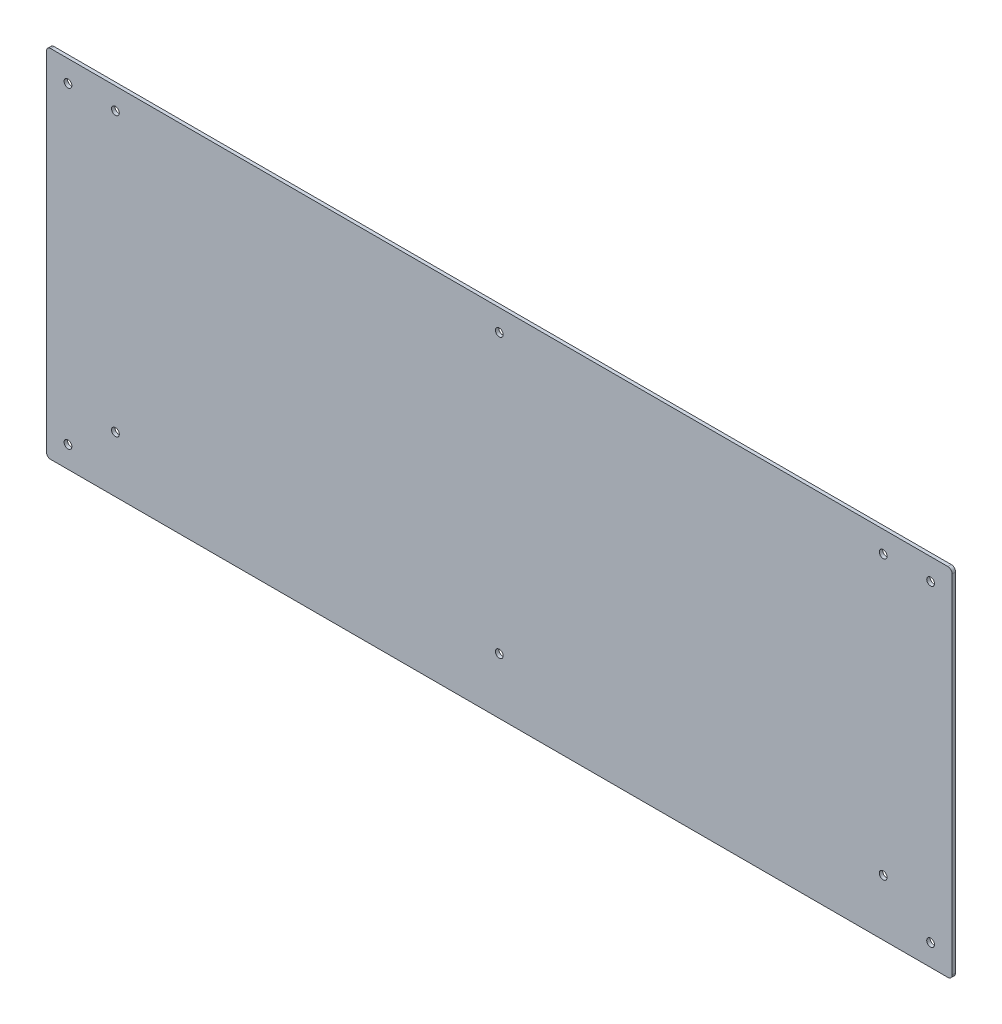
ISO-10303-21;
HEADER;
FILE_DESCRIPTION(('STEP AP214'),'2;1');
FILE_NAME('part.step','',(''),(''),'','','');
FILE_SCHEMA(('AUTOMOTIVE_DESIGN { 1 0 10303 214 1 1 1 1 }'));
ENDSEC;
DATA;
#1=APPLICATION_CONTEXT('core data for automotive mechanical design processes');
#2=APPLICATION_PROTOCOL_DEFINITION('international standard','automotive_design',2000,#1);
#3=PRODUCT_CONTEXT('',#1,'mechanical');
#4=PRODUCT('Part','Part','',(#3));
#5=PRODUCT_RELATED_PRODUCT_CATEGORY('part','',(#4));
#6=PRODUCT_DEFINITION_FORMATION('','',#4);
#7=PRODUCT_DEFINITION_CONTEXT('part definition',#1,'design');
#8=PRODUCT_DEFINITION('design','',#6,#7);
#9=PRODUCT_DEFINITION_SHAPE('','',#8);
#10=(LENGTH_UNIT() NAMED_UNIT(*) SI_UNIT(.MILLI.,.METRE.));
#11=(NAMED_UNIT(*) PLANE_ANGLE_UNIT() SI_UNIT($,.RADIAN.));
#12=(NAMED_UNIT(*) SI_UNIT($,.STERADIAN.) SOLID_ANGLE_UNIT());
#13=UNCERTAINTY_MEASURE_WITH_UNIT(LENGTH_MEASURE(1.E-05),#10,'distance_accuracy_value','');
#14=(GEOMETRIC_REPRESENTATION_CONTEXT(3) GLOBAL_UNCERTAINTY_ASSIGNED_CONTEXT((#13)) GLOBAL_UNIT_ASSIGNED_CONTEXT((#10,
#11,#12)) REPRESENTATION_CONTEXT('',''));
#15=CARTESIAN_POINT('',(0.,0.,0.));
#16=DIRECTION('',(0.,0.,1.));
#17=DIRECTION('',(1.,0.,0.));
#18=AXIS2_PLACEMENT_3D('',#15,#16,#17);
#19=CARTESIAN_POINT('',(-210.,-82.5,-1.588));
#20=DIRECTION('',(-1.,0.,0.));
#21=DIRECTION('',(0.,0.,1.));
#22=AXIS2_PLACEMENT_3D('',#19,#20,#21);
#23=PLANE('',#22);
#24=DIRECTION('',(0.,-1.,0.));
#25=VECTOR('',#24,1.);
#26=CARTESIAN_POINT('',(-210.,-82.5,-1.588));
#27=LINE('',#26,#25);
#28=CARTESIAN_POINT('',(-210.,80.5,-1.588));
#29=VERTEX_POINT('',#28);
#30=CARTESIAN_POINT('',(-210.,-80.5,-1.588));
#31=VERTEX_POINT('',#30);
#32=EDGE_CURVE('E158',#29,#31,#27,.T.);
#33=ORIENTED_EDGE('',*,*,#32,.T.);
#34=DIRECTION('',(0.,0.,1.));
#35=VECTOR('',#34,1.);
#36=CARTESIAN_POINT('',(-210.,-80.5,-1.588));
#37=LINE('',#36,#35);
#38=CARTESIAN_POINT('',(-210.,-80.5,0.));
#39=VERTEX_POINT('',#38);
#40=EDGE_CURVE('E11',#31,#39,#37,.T.);
#41=ORIENTED_EDGE('',*,*,#40,.T.);
#42=DIRECTION('',(0.,-1.,0.));
#43=VECTOR('',#42,1.);
#44=CARTESIAN_POINT('',(-210.,-82.5,0.));
#45=LINE('',#44,#43);
#46=CARTESIAN_POINT('',(-210.,80.5,0.));
#47=VERTEX_POINT('',#46);
#48=EDGE_CURVE('E161',#47,#39,#45,.T.);
#49=ORIENTED_EDGE('',*,*,#48,.F.);
#50=DIRECTION('',(0.,0.,1.));
#51=VECTOR('',#50,1.);
#52=CARTESIAN_POINT('',(-210.,80.5,-1.588));
#53=LINE('',#52,#51);
#54=EDGE_CURVE('E46',#47,#29,#53,.F.);
#55=ORIENTED_EDGE('',*,*,#54,.T.);
#56=EDGE_LOOP('',(#33,#41,#49,#55));
#57=FACE_BOUND('',#56,.T.);
#58=ADVANCED_FACE('F38',(#57),#23,.T.);
#59=CARTESIAN_POINT('',(210.,82.5,-1.588));
#60=DIRECTION('',(0.,1.,0.));
#61=DIRECTION('',(-1.,0.,0.));
#62=AXIS2_PLACEMENT_3D('',#59,#60,#61);
#63=PLANE('',#62);
#64=DIRECTION('',(-1.,0.,0.));
#65=VECTOR('',#64,1.);
#66=CARTESIAN_POINT('',(210.,82.5,0.));
#67=LINE('',#66,#65);
#68=CARTESIAN_POINT('',(208.,82.5,0.));
#69=VERTEX_POINT('',#68);
#70=CARTESIAN_POINT('',(-208.,82.5,0.));
#71=VERTEX_POINT('',#70);
#72=EDGE_CURVE('E124',#69,#71,#67,.T.);
#73=ORIENTED_EDGE('',*,*,#72,.F.);
#74=DIRECTION('',(0.,0.,1.));
#75=VECTOR('',#74,1.);
#76=CARTESIAN_POINT('',(208.,82.5,-1.588));
#77=LINE('',#76,#75);
#78=CARTESIAN_POINT('',(208.,82.5,-1.588));
#79=VERTEX_POINT('',#78);
#80=EDGE_CURVE('E142',#69,#79,#77,.F.);
#81=ORIENTED_EDGE('',*,*,#80,.T.);
#82=DIRECTION('',(-1.,0.,0.));
#83=VECTOR('',#82,1.);
#84=CARTESIAN_POINT('',(210.,82.5,-1.588));
#85=LINE('',#84,#83);
#86=CARTESIAN_POINT('',(-208.,82.5,-1.588));
#87=VERTEX_POINT('',#86);
#88=EDGE_CURVE('E127',#79,#87,#85,.T.);
#89=ORIENTED_EDGE('',*,*,#88,.T.);
#90=DIRECTION('',(0.,0.,1.));
#91=VECTOR('',#90,1.);
#92=CARTESIAN_POINT('',(-208.,82.5,-1.588));
#93=LINE('',#92,#91);
#94=EDGE_CURVE('E139',#87,#71,#93,.T.);
#95=ORIENTED_EDGE('',*,*,#94,.T.);
#96=EDGE_LOOP('',(#73,#81,#89,#95));
#97=FACE_BOUND('',#96,.T.);
#98=ADVANCED_FACE('F173',(#97),#63,.T.);
#99=CARTESIAN_POINT('',(210.,-82.5,-1.588));
#100=DIRECTION('',(1.,0.,0.));
#101=DIRECTION('',(0.,0.,-1.));
#102=AXIS2_PLACEMENT_3D('',#99,#100,#101);
#103=PLANE('',#102);
#104=DIRECTION('',(0.,1.,0.));
#105=VECTOR('',#104,1.);
#106=CARTESIAN_POINT('',(210.,-82.5,-1.588));
#107=LINE('',#106,#105);
#108=CARTESIAN_POINT('',(210.,-80.5,-1.588));
#109=VERTEX_POINT('',#108);
#110=CARTESIAN_POINT('',(210.,80.5,-1.588));
#111=VERTEX_POINT('',#110);
#112=EDGE_CURVE('E132',#109,#111,#107,.T.);
#113=ORIENTED_EDGE('',*,*,#112,.T.);
#114=DIRECTION('',(0.,0.,1.));
#115=VECTOR('',#114,1.);
#116=CARTESIAN_POINT('',(210.,80.5,-1.588));
#117=LINE('',#116,#115);
#118=CARTESIAN_POINT('',(210.,80.5,0.));
#119=VERTEX_POINT('',#118);
#120=EDGE_CURVE('E123',#111,#119,#117,.T.);
#121=ORIENTED_EDGE('',*,*,#120,.T.);
#122=DIRECTION('',(0.,1.,0.));
#123=VECTOR('',#122,1.);
#124=CARTESIAN_POINT('',(210.,-82.5,0.));
#125=LINE('',#124,#123);
#126=CARTESIAN_POINT('',(210.,-80.5,0.));
#127=VERTEX_POINT('',#126);
#128=EDGE_CURVE('E108',#127,#119,#125,.T.);
#129=ORIENTED_EDGE('',*,*,#128,.F.);
#130=DIRECTION('',(0.,0.,1.));
#131=VECTOR('',#130,1.);
#132=CARTESIAN_POINT('',(210.,-80.5,-1.588));
#133=LINE('',#132,#131);
#134=EDGE_CURVE('E121',#127,#109,#133,.F.);
#135=ORIENTED_EDGE('',*,*,#134,.T.);
#136=EDGE_LOOP('',(#113,#121,#129,#135));
#137=FACE_BOUND('',#136,.T.);
#138=ADVANCED_FACE('F120',(#137),#103,.T.);
#139=CARTESIAN_POINT('',(210.,-82.5,-1.588));
#140=DIRECTION('',(0.,-1.,0.));
#141=DIRECTION('',(1.,0.,0.));
#142=AXIS2_PLACEMENT_3D('',#139,#140,#141);
#143=PLANE('',#142);
#144=DIRECTION('',(1.,0.,0.));
#145=VECTOR('',#144,1.);
#146=CARTESIAN_POINT('',(210.,-82.5,-1.588));
#147=LINE('',#146,#145);
#148=CARTESIAN_POINT('',(-208.,-82.5,-1.588));
#149=VERTEX_POINT('',#148);
#150=CARTESIAN_POINT('',(208.,-82.5,-1.588));
#151=VERTEX_POINT('',#150);
#152=EDGE_CURVE('E167',#149,#151,#147,.T.);
#153=ORIENTED_EDGE('',*,*,#152,.T.);
#154=DIRECTION('',(0.,0.,1.));
#155=VECTOR('',#154,1.);
#156=CARTESIAN_POINT('',(208.,-82.5,-1.588));
#157=LINE('',#156,#155);
#158=CARTESIAN_POINT('',(208.,-82.5,0.));
#159=VERTEX_POINT('',#158);
#160=EDGE_CURVE('E152',#151,#159,#157,.T.);
#161=ORIENTED_EDGE('',*,*,#160,.T.);
#162=DIRECTION('',(1.,0.,0.));
#163=VECTOR('',#162,1.);
#164=CARTESIAN_POINT('',(210.,-82.5,0.));
#165=LINE('',#164,#163);
#166=CARTESIAN_POINT('',(-208.,-82.5,0.));
#167=VERTEX_POINT('',#166);
#168=EDGE_CURVE('E109',#167,#159,#165,.T.);
#169=ORIENTED_EDGE('',*,*,#168,.F.);
#170=DIRECTION('',(0.,0.,1.));
#171=VECTOR('',#170,1.);
#172=CARTESIAN_POINT('',(-208.,-82.5,-1.588));
#173=LINE('',#172,#171);
#174=EDGE_CURVE('E60',#167,#149,#173,.F.);
#175=ORIENTED_EDGE('',*,*,#174,.T.);
#176=EDGE_LOOP('',(#153,#161,#169,#175));
#177=FACE_BOUND('',#176,.T.);
#178=ADVANCED_FACE('F291',(#177),#143,.T.);
#179=CARTESIAN_POINT('',(0.,0.,-1.588));
#180=DIRECTION('',(0.,0.,1.));
#181=DIRECTION('',(1.,0.,0.));
#182=AXIS2_PLACEMENT_3D('',#179,#180,#181);
#183=PLANE('',#182);
#184=CARTESIAN_POINT('',(200.,72.5,-1.588));
#185=DIRECTION('',(0.,0.,1.));
#186=DIRECTION('',(1.,0.,0.));
#187=AXIS2_PLACEMENT_3D('',#184,#185,#186);
#188=CIRCLE('',#187,1.8);
#189=CARTESIAN_POINT('',(201.8,72.5,-1.588));
#190=VERTEX_POINT('',#189);
#191=EDGE_CURVE('E239',#190,#190,#188,.T.);
#192=ORIENTED_EDGE('',*,*,#191,.T.);
#193=EDGE_LOOP('',(#192));
#194=FACE_BOUND('',#193,.T.);
#195=CARTESIAN_POINT('',(178.,72.5,-1.588));
#196=DIRECTION('',(0.,0.,1.));
#197=DIRECTION('',(1.,0.,0.));
#198=AXIS2_PLACEMENT_3D('',#195,#196,#197);
#199=CIRCLE('',#198,1.8);
#200=CARTESIAN_POINT('',(179.8,72.5,-1.588));
#201=VERTEX_POINT('',#200);
#202=EDGE_CURVE('E233',#201,#201,#199,.T.);
#203=ORIENTED_EDGE('',*,*,#202,.T.);
#204=EDGE_LOOP('',(#203));
#205=FACE_BOUND('',#204,.T.);
#206=CARTESIAN_POINT('',(178.,-56.5,-1.588));
#207=DIRECTION('',(0.,0.,1.));
#208=DIRECTION('',(1.,0.,0.));
#209=AXIS2_PLACEMENT_3D('',#206,#207,#208);
#210=CIRCLE('',#209,1.8);
#211=CARTESIAN_POINT('',(179.8,-56.5,-1.588));
#212=VERTEX_POINT('',#211);
#213=EDGE_CURVE('E227',#212,#212,#210,.T.);
#214=ORIENTED_EDGE('',*,*,#213,.T.);
#215=EDGE_LOOP('',(#214));
#216=FACE_BOUND('',#215,.T.);
#217=CARTESIAN_POINT('',(200.,-72.5000000000001,-1.588));
#218=DIRECTION('',(0.,0.,1.));
#219=DIRECTION('',(1.,0.,0.));
#220=AXIS2_PLACEMENT_3D('',#217,#218,#219);
#221=CIRCLE('',#220,1.8);
#222=CARTESIAN_POINT('',(201.8,-72.5000000000001,-1.588));
#223=VERTEX_POINT('',#222);
#224=EDGE_CURVE('E221',#223,#223,#221,.T.);
#225=ORIENTED_EDGE('',*,*,#224,.T.);
#226=EDGE_LOOP('',(#225));
#227=FACE_BOUND('',#226,.T.);
#228=CARTESIAN_POINT('',(-200.,72.5,-1.588));
#229=DIRECTION('',(0.,0.,1.));
#230=DIRECTION('',(1.,0.,0.));
#231=AXIS2_PLACEMENT_3D('',#228,#229,#230);
#232=CIRCLE('',#231,1.8);
#233=CARTESIAN_POINT('',(-198.2,72.5,-1.588));
#234=VERTEX_POINT('',#233);
#235=EDGE_CURVE('E215',#234,#234,#232,.T.);
#236=ORIENTED_EDGE('',*,*,#235,.T.);
#237=EDGE_LOOP('',(#236));
#238=FACE_BOUND('',#237,.T.);
#239=CARTESIAN_POINT('',(-178.,72.5,-1.588));
#240=DIRECTION('',(0.,0.,1.));
#241=DIRECTION('',(1.,0.,0.));
#242=AXIS2_PLACEMENT_3D('',#239,#240,#241);
#243=CIRCLE('',#242,1.8);
#244=CARTESIAN_POINT('',(-176.2,72.5,-1.588));
#245=VERTEX_POINT('',#244);
#246=EDGE_CURVE('E209',#245,#245,#243,.T.);
#247=ORIENTED_EDGE('',*,*,#246,.T.);
#248=EDGE_LOOP('',(#247));
#249=FACE_BOUND('',#248,.T.);
#250=CARTESIAN_POINT('',(0.,72.5,-1.588));
#251=DIRECTION('',(0.,0.,1.));
#252=DIRECTION('',(1.,0.,0.));
#253=AXIS2_PLACEMENT_3D('',#250,#251,#252);
#254=CIRCLE('',#253,1.8);
#255=CARTESIAN_POINT('',(1.8,72.5,-1.588));
#256=VERTEX_POINT('',#255);
#257=EDGE_CURVE('E203',#256,#256,#254,.T.);
#258=ORIENTED_EDGE('',*,*,#257,.T.);
#259=EDGE_LOOP('',(#258));
#260=FACE_BOUND('',#259,.T.);
#261=CARTESIAN_POINT('',(0.,-56.5,-1.588));
#262=DIRECTION('',(0.,0.,1.));
#263=DIRECTION('',(1.,0.,0.));
#264=AXIS2_PLACEMENT_3D('',#261,#262,#263);
#265=CIRCLE('',#264,1.8);
#266=CARTESIAN_POINT('',(1.80000000000003,-56.5,-1.588));
#267=VERTEX_POINT('',#266);
#268=EDGE_CURVE('E197',#267,#267,#265,.T.);
#269=ORIENTED_EDGE('',*,*,#268,.T.);
#270=EDGE_LOOP('',(#269));
#271=FACE_BOUND('',#270,.T.);
#272=CARTESIAN_POINT('',(-178.,-56.5,-1.588));
#273=DIRECTION('',(0.,0.,1.));
#274=DIRECTION('',(1.,0.,0.));
#275=AXIS2_PLACEMENT_3D('',#272,#273,#274);
#276=CIRCLE('',#275,1.8);
#277=CARTESIAN_POINT('',(-176.2,-56.5,-1.588));
#278=VERTEX_POINT('',#277);
#279=EDGE_CURVE('E189',#278,#278,#276,.T.);
#280=ORIENTED_EDGE('',*,*,#279,.T.);
#281=EDGE_LOOP('',(#280));
#282=FACE_BOUND('',#281,.T.);
#283=CARTESIAN_POINT('',(-200.,-72.5000000000001,-1.588));
#284=DIRECTION('',(0.,0.,1.));
#285=DIRECTION('',(1.,0.,0.));
#286=AXIS2_PLACEMENT_3D('',#283,#284,#285);
#287=CIRCLE('',#286,1.8);
#288=CARTESIAN_POINT('',(-198.2,-72.5000000000001,-1.588));
#289=VERTEX_POINT('',#288);
#290=EDGE_CURVE('E182',#289,#289,#287,.T.);
#291=ORIENTED_EDGE('',*,*,#290,.T.);
#292=EDGE_LOOP('',(#291));
#293=FACE_BOUND('',#292,.T.);
#294=ORIENTED_EDGE('',*,*,#88,.F.);
#295=CARTESIAN_POINT('',(208.,80.5,-1.588));
#296=DIRECTION('',(0.,0.,1.));
#297=DIRECTION('',(1.,0.,0.));
#298=AXIS2_PLACEMENT_3D('',#295,#296,#297);
#299=CIRCLE('',#298,2.);
#300=EDGE_CURVE('E149',#79,#111,#299,.F.);
#301=ORIENTED_EDGE('',*,*,#300,.T.);
#302=ORIENTED_EDGE('',*,*,#112,.F.);
#303=CARTESIAN_POINT('',(208.,-80.5,-1.588));
#304=DIRECTION('',(0.,0.,1.));
#305=DIRECTION('',(1.,0.,0.));
#306=AXIS2_PLACEMENT_3D('',#303,#304,#305);
#307=CIRCLE('',#306,2.);
#308=EDGE_CURVE('E53',#109,#151,#307,.F.);
#309=ORIENTED_EDGE('',*,*,#308,.T.);
#310=ORIENTED_EDGE('',*,*,#152,.F.);
#311=CARTESIAN_POINT('',(-208.,-80.5,-1.588));
#312=DIRECTION('',(0.,0.,1.));
#313=DIRECTION('',(1.,0.,0.));
#314=AXIS2_PLACEMENT_3D('',#311,#312,#313);
#315=CIRCLE('',#314,2.);
#316=EDGE_CURVE('E146',#149,#31,#315,.F.);
#317=ORIENTED_EDGE('',*,*,#316,.T.);
#318=ORIENTED_EDGE('',*,*,#32,.F.);
#319=CARTESIAN_POINT('',(-208.,80.5,-1.588));
#320=DIRECTION('',(0.,0.,1.));
#321=DIRECTION('',(1.,0.,0.));
#322=AXIS2_PLACEMENT_3D('',#319,#320,#321);
#323=CIRCLE('',#322,2.);
#324=EDGE_CURVE('E144',#29,#87,#323,.F.);
#325=ORIENTED_EDGE('',*,*,#324,.T.);
#326=EDGE_LOOP('',(#294,#301,#302,#309,#310,#317,#318,#325));
#327=FACE_BOUND('',#326,.T.);
#328=ADVANCED_FACE('F165',(#194,#205,#216,#227,#238,#249,#260,#271,#282,#293,#327),#183,.F.);
#329=CARTESIAN_POINT('',(0.,0.,0.));
#330=DIRECTION('',(0.,0.,1.));
#331=DIRECTION('',(1.,0.,0.));
#332=AXIS2_PLACEMENT_3D('',#329,#330,#331);
#333=PLANE('',#332);
#334=CARTESIAN_POINT('',(200.,72.5,0.));
#335=DIRECTION('',(0.,0.,1.));
#336=DIRECTION('',(1.,0.,0.));
#337=AXIS2_PLACEMENT_3D('',#334,#335,#336);
#338=CIRCLE('',#337,1.8);
#339=CARTESIAN_POINT('',(201.8,72.5,0.));
#340=VERTEX_POINT('',#339);
#341=EDGE_CURVE('E242',#340,#340,#338,.T.);
#342=ORIENTED_EDGE('',*,*,#341,.F.);
#343=EDGE_LOOP('',(#342));
#344=FACE_BOUND('',#343,.T.);
#345=CARTESIAN_POINT('',(178.,72.5,0.));
#346=DIRECTION('',(0.,0.,1.));
#347=DIRECTION('',(1.,0.,0.));
#348=AXIS2_PLACEMENT_3D('',#345,#346,#347);
#349=CIRCLE('',#348,1.8);
#350=CARTESIAN_POINT('',(179.8,72.5,0.));
#351=VERTEX_POINT('',#350);
#352=EDGE_CURVE('E236',#351,#351,#349,.T.);
#353=ORIENTED_EDGE('',*,*,#352,.F.);
#354=EDGE_LOOP('',(#353));
#355=FACE_BOUND('',#354,.T.);
#356=CARTESIAN_POINT('',(178.,-56.5,0.));
#357=DIRECTION('',(0.,0.,1.));
#358=DIRECTION('',(1.,0.,0.));
#359=AXIS2_PLACEMENT_3D('',#356,#357,#358);
#360=CIRCLE('',#359,1.8);
#361=CARTESIAN_POINT('',(179.8,-56.5,0.));
#362=VERTEX_POINT('',#361);
#363=EDGE_CURVE('E230',#362,#362,#360,.T.);
#364=ORIENTED_EDGE('',*,*,#363,.F.);
#365=EDGE_LOOP('',(#364));
#366=FACE_BOUND('',#365,.T.);
#367=CARTESIAN_POINT('',(200.,-72.5000000000001,0.));
#368=DIRECTION('',(0.,0.,1.));
#369=DIRECTION('',(1.,0.,0.));
#370=AXIS2_PLACEMENT_3D('',#367,#368,#369);
#371=CIRCLE('',#370,1.8);
#372=CARTESIAN_POINT('',(201.8,-72.5000000000001,0.));
#373=VERTEX_POINT('',#372);
#374=EDGE_CURVE('E224',#373,#373,#371,.T.);
#375=ORIENTED_EDGE('',*,*,#374,.F.);
#376=EDGE_LOOP('',(#375));
#377=FACE_BOUND('',#376,.T.);
#378=CARTESIAN_POINT('',(-200.,72.5,0.));
#379=DIRECTION('',(0.,0.,1.));
#380=DIRECTION('',(1.,0.,0.));
#381=AXIS2_PLACEMENT_3D('',#378,#379,#380);
#382=CIRCLE('',#381,1.8);
#383=CARTESIAN_POINT('',(-198.2,72.5,0.));
#384=VERTEX_POINT('',#383);
#385=EDGE_CURVE('E218',#384,#384,#382,.T.);
#386=ORIENTED_EDGE('',*,*,#385,.F.);
#387=EDGE_LOOP('',(#386));
#388=FACE_BOUND('',#387,.T.);
#389=CARTESIAN_POINT('',(-178.,72.5,0.));
#390=DIRECTION('',(0.,0.,1.));
#391=DIRECTION('',(1.,0.,0.));
#392=AXIS2_PLACEMENT_3D('',#389,#390,#391);
#393=CIRCLE('',#392,1.8);
#394=CARTESIAN_POINT('',(-176.2,72.5,0.));
#395=VERTEX_POINT('',#394);
#396=EDGE_CURVE('E212',#395,#395,#393,.T.);
#397=ORIENTED_EDGE('',*,*,#396,.F.);
#398=EDGE_LOOP('',(#397));
#399=FACE_BOUND('',#398,.T.);
#400=CARTESIAN_POINT('',(0.,72.5,0.));
#401=DIRECTION('',(0.,0.,1.));
#402=DIRECTION('',(1.,0.,0.));
#403=AXIS2_PLACEMENT_3D('',#400,#401,#402);
#404=CIRCLE('',#403,1.79999999999999);
#405=CARTESIAN_POINT('',(1.79999999999999,72.5,0.));
#406=VERTEX_POINT('',#405);
#407=EDGE_CURVE('E206',#406,#406,#404,.T.);
#408=ORIENTED_EDGE('',*,*,#407,.F.);
#409=EDGE_LOOP('',(#408));
#410=FACE_BOUND('',#409,.T.);
#411=CARTESIAN_POINT('',(0.,-56.5,0.));
#412=DIRECTION('',(0.,0.,1.));
#413=DIRECTION('',(1.,0.,0.));
#414=AXIS2_PLACEMENT_3D('',#411,#412,#413);
#415=CIRCLE('',#414,1.79999999999999);
#416=CARTESIAN_POINT('',(1.80000000000002,-56.5,0.));
#417=VERTEX_POINT('',#416);
#418=EDGE_CURVE('E200',#417,#417,#415,.T.);
#419=ORIENTED_EDGE('',*,*,#418,.F.);
#420=EDGE_LOOP('',(#419));
#421=FACE_BOUND('',#420,.T.);
#422=CARTESIAN_POINT('',(-178.,-56.5,0.));
#423=DIRECTION('',(0.,0.,1.));
#424=DIRECTION('',(1.,0.,0.));
#425=AXIS2_PLACEMENT_3D('',#422,#423,#424);
#426=CIRCLE('',#425,1.8);
#427=CARTESIAN_POINT('',(-176.2,-56.5,0.));
#428=VERTEX_POINT('',#427);
#429=EDGE_CURVE('E194',#428,#428,#426,.T.);
#430=ORIENTED_EDGE('',*,*,#429,.F.);
#431=EDGE_LOOP('',(#430));
#432=FACE_BOUND('',#431,.T.);
#433=CARTESIAN_POINT('',(-200.,-72.5000000000001,0.));
#434=DIRECTION('',(0.,0.,1.));
#435=DIRECTION('',(1.,0.,0.));
#436=AXIS2_PLACEMENT_3D('',#433,#434,#435);
#437=CIRCLE('',#436,1.8);
#438=CARTESIAN_POINT('',(-198.2,-72.5000000000001,0.));
#439=VERTEX_POINT('',#438);
#440=EDGE_CURVE('E184',#439,#439,#437,.T.);
#441=ORIENTED_EDGE('',*,*,#440,.F.);
#442=EDGE_LOOP('',(#441));
#443=FACE_BOUND('',#442,.T.);
#444=ORIENTED_EDGE('',*,*,#128,.T.);
#445=CARTESIAN_POINT('',(208.,80.5,0.));
#446=DIRECTION('',(0.,0.,1.));
#447=DIRECTION('',(1.,0.,0.));
#448=AXIS2_PLACEMENT_3D('',#445,#446,#447);
#449=CIRCLE('',#448,2.);
#450=EDGE_CURVE('E114',#119,#69,#449,.T.);
#451=ORIENTED_EDGE('',*,*,#450,.T.);
#452=ORIENTED_EDGE('',*,*,#72,.T.);
#453=CARTESIAN_POINT('',(-208.,80.5,0.));
#454=DIRECTION('',(0.,0.,1.));
#455=DIRECTION('',(1.,0.,0.));
#456=AXIS2_PLACEMENT_3D('',#453,#454,#455);
#457=CIRCLE('',#456,2.);
#458=EDGE_CURVE('E129',#71,#47,#457,.T.);
#459=ORIENTED_EDGE('',*,*,#458,.T.);
#460=ORIENTED_EDGE('',*,*,#48,.T.);
#461=CARTESIAN_POINT('',(-208.,-80.5,0.));
#462=DIRECTION('',(0.,0.,1.));
#463=DIRECTION('',(1.,0.,0.));
#464=AXIS2_PLACEMENT_3D('',#461,#462,#463);
#465=CIRCLE('',#464,2.);
#466=EDGE_CURVE('E115',#39,#167,#465,.T.);
#467=ORIENTED_EDGE('',*,*,#466,.T.);
#468=ORIENTED_EDGE('',*,*,#168,.T.);
#469=CARTESIAN_POINT('',(208.,-80.5,0.));
#470=DIRECTION('',(0.,0.,1.));
#471=DIRECTION('',(1.,0.,0.));
#472=AXIS2_PLACEMENT_3D('',#469,#470,#471);
#473=CIRCLE('',#472,2.);
#474=EDGE_CURVE('E105',#159,#127,#473,.T.);
#475=ORIENTED_EDGE('',*,*,#474,.T.);
#476=EDGE_LOOP('',(#444,#451,#452,#459,#460,#467,#468,#475));
#477=FACE_BOUND('',#476,.T.);
#478=ADVANCED_FACE('F107',(#344,#355,#366,#377,#388,#399,#410,#421,#432,#443,#477),#333,.T.);
#479=CARTESIAN_POINT('',(208.,80.5,-1.588));
#480=DIRECTION('',(0.,0.,1.));
#481=DIRECTION('',(1.,0.,0.));
#482=AXIS2_PLACEMENT_3D('',#479,#480,#481);
#483=CYLINDRICAL_SURFACE('',#482,2.);
#484=ORIENTED_EDGE('',*,*,#300,.F.);
#485=ORIENTED_EDGE('',*,*,#80,.F.);
#486=ORIENTED_EDGE('',*,*,#450,.F.);
#487=ORIENTED_EDGE('',*,*,#120,.F.);
#488=EDGE_LOOP('',(#484,#485,#486,#487));
#489=FACE_BOUND('',#488,.T.);
#490=ADVANCED_FACE('F177',(#489),#483,.T.);
#491=CARTESIAN_POINT('',(208.,-80.5,-1.588));
#492=DIRECTION('',(0.,0.,1.));
#493=DIRECTION('',(1.,0.,0.));
#494=AXIS2_PLACEMENT_3D('',#491,#492,#493);
#495=CYLINDRICAL_SURFACE('',#494,2.);
#496=ORIENTED_EDGE('',*,*,#308,.F.);
#497=ORIENTED_EDGE('',*,*,#134,.F.);
#498=ORIENTED_EDGE('',*,*,#474,.F.);
#499=ORIENTED_EDGE('',*,*,#160,.F.);
#500=EDGE_LOOP('',(#496,#497,#498,#499));
#501=FACE_BOUND('',#500,.T.);
#502=ADVANCED_FACE('F126',(#501),#495,.T.);
#503=CARTESIAN_POINT('',(-208.,-80.5,-1.588));
#504=DIRECTION('',(0.,0.,1.));
#505=DIRECTION('',(1.,0.,0.));
#506=AXIS2_PLACEMENT_3D('',#503,#504,#505);
#507=CYLINDRICAL_SURFACE('',#506,2.);
#508=ORIENTED_EDGE('',*,*,#316,.F.);
#509=ORIENTED_EDGE('',*,*,#174,.F.);
#510=ORIENTED_EDGE('',*,*,#466,.F.);
#511=ORIENTED_EDGE('',*,*,#40,.F.);
#512=EDGE_LOOP('',(#508,#509,#510,#511));
#513=FACE_BOUND('',#512,.T.);
#514=ADVANCED_FACE('F281',(#513),#507,.T.);
#515=CARTESIAN_POINT('',(-208.,80.5,-1.588));
#516=DIRECTION('',(0.,0.,1.));
#517=DIRECTION('',(1.,0.,0.));
#518=AXIS2_PLACEMENT_3D('',#515,#516,#517);
#519=CYLINDRICAL_SURFACE('',#518,2.);
#520=ORIENTED_EDGE('',*,*,#324,.F.);
#521=ORIENTED_EDGE('',*,*,#54,.F.);
#522=ORIENTED_EDGE('',*,*,#458,.F.);
#523=ORIENTED_EDGE('',*,*,#94,.F.);
#524=EDGE_LOOP('',(#520,#521,#522,#523));
#525=FACE_BOUND('',#524,.T.);
#526=ADVANCED_FACE('F40',(#525),#519,.T.);
#527=CARTESIAN_POINT('',(-200.,-72.5000000000001,0.));
#528=DIRECTION('',(0.,0.,1.));
#529=DIRECTION('',(1.,0.,0.));
#530=AXIS2_PLACEMENT_3D('',#527,#528,#529);
#531=CYLINDRICAL_SURFACE('',#530,1.8);
#532=ORIENTED_EDGE('',*,*,#290,.F.);
#533=EDGE_LOOP('',(#532));
#534=FACE_BOUND('',#533,.T.);
#535=ORIENTED_EDGE('',*,*,#440,.T.);
#536=EDGE_LOOP('',(#535));
#537=FACE_BOUND('',#536,.T.);
#538=ADVANCED_FACE('F269',(#534,#537),#531,.F.);
#539=CARTESIAN_POINT('',(-178.,-56.5,0.));
#540=DIRECTION('',(0.,0.,1.));
#541=DIRECTION('',(1.,0.,0.));
#542=AXIS2_PLACEMENT_3D('',#539,#540,#541);
#543=CYLINDRICAL_SURFACE('',#542,1.8);
#544=ORIENTED_EDGE('',*,*,#279,.F.);
#545=EDGE_LOOP('',(#544));
#546=FACE_BOUND('',#545,.T.);
#547=ORIENTED_EDGE('',*,*,#429,.T.);
#548=EDGE_LOOP('',(#547));
#549=FACE_BOUND('',#548,.T.);
#550=ADVANCED_FACE('F271',(#546,#549),#543,.F.);
#551=CARTESIAN_POINT('',(0.,-56.5,0.));
#552=DIRECTION('',(0.,0.,1.));
#553=DIRECTION('',(1.,0.,0.));
#554=AXIS2_PLACEMENT_3D('',#551,#552,#553);
#555=CYLINDRICAL_SURFACE('',#554,1.79999999999999);
#556=ORIENTED_EDGE('',*,*,#268,.F.);
#557=EDGE_LOOP('',(#556));
#558=FACE_BOUND('',#557,.T.);
#559=ORIENTED_EDGE('',*,*,#418,.T.);
#560=EDGE_LOOP('',(#559));
#561=FACE_BOUND('',#560,.T.);
#562=ADVANCED_FACE('F278',(#558,#561),#555,.F.);
#563=CARTESIAN_POINT('',(0.,72.5,0.));
#564=DIRECTION('',(0.,0.,1.));
#565=DIRECTION('',(1.,0.,0.));
#566=AXIS2_PLACEMENT_3D('',#563,#564,#565);
#567=CYLINDRICAL_SURFACE('',#566,1.79999999999999);
#568=ORIENTED_EDGE('',*,*,#257,.F.);
#569=EDGE_LOOP('',(#568));
#570=FACE_BOUND('',#569,.T.);
#571=ORIENTED_EDGE('',*,*,#407,.T.);
#572=EDGE_LOOP('',(#571));
#573=FACE_BOUND('',#572,.T.);
#574=ADVANCED_FACE('F384',(#570,#573),#567,.F.);
#575=CARTESIAN_POINT('',(-178.,72.5,0.));
#576=DIRECTION('',(0.,0.,1.));
#577=DIRECTION('',(1.,0.,0.));
#578=AXIS2_PLACEMENT_3D('',#575,#576,#577);
#579=CYLINDRICAL_SURFACE('',#578,1.8);
#580=ORIENTED_EDGE('',*,*,#246,.F.);
#581=EDGE_LOOP('',(#580));
#582=FACE_BOUND('',#581,.T.);
#583=ORIENTED_EDGE('',*,*,#396,.T.);
#584=EDGE_LOOP('',(#583));
#585=FACE_BOUND('',#584,.T.);
#586=ADVANCED_FACE('F393',(#582,#585),#579,.F.);
#587=CARTESIAN_POINT('',(-200.,72.5,0.));
#588=DIRECTION('',(0.,0.,1.));
#589=DIRECTION('',(1.,0.,0.));
#590=AXIS2_PLACEMENT_3D('',#587,#588,#589);
#591=CYLINDRICAL_SURFACE('',#590,1.8);
#592=ORIENTED_EDGE('',*,*,#235,.F.);
#593=EDGE_LOOP('',(#592));
#594=FACE_BOUND('',#593,.T.);
#595=ORIENTED_EDGE('',*,*,#385,.T.);
#596=EDGE_LOOP('',(#595));
#597=FACE_BOUND('',#596,.T.);
#598=ADVANCED_FACE('F402',(#594,#597),#591,.F.);
#599=CARTESIAN_POINT('',(200.,-72.5000000000001,0.));
#600=DIRECTION('',(0.,0.,1.));
#601=DIRECTION('',(1.,0.,0.));
#602=AXIS2_PLACEMENT_3D('',#599,#600,#601);
#603=CYLINDRICAL_SURFACE('',#602,1.8);
#604=ORIENTED_EDGE('',*,*,#224,.F.);
#605=EDGE_LOOP('',(#604));
#606=FACE_BOUND('',#605,.T.);
#607=ORIENTED_EDGE('',*,*,#374,.T.);
#608=EDGE_LOOP('',(#607));
#609=FACE_BOUND('',#608,.T.);
#610=ADVANCED_FACE('F411',(#606,#609),#603,.F.);
#611=CARTESIAN_POINT('',(178.,-56.5,0.));
#612=DIRECTION('',(0.,0.,1.));
#613=DIRECTION('',(1.,0.,0.));
#614=AXIS2_PLACEMENT_3D('',#611,#612,#613);
#615=CYLINDRICAL_SURFACE('',#614,1.8);
#616=ORIENTED_EDGE('',*,*,#213,.F.);
#617=EDGE_LOOP('',(#616));
#618=FACE_BOUND('',#617,.T.);
#619=ORIENTED_EDGE('',*,*,#363,.T.);
#620=EDGE_LOOP('',(#619));
#621=FACE_BOUND('',#620,.T.);
#622=ADVANCED_FACE('F420',(#618,#621),#615,.F.);
#623=CARTESIAN_POINT('',(178.,72.5,0.));
#624=DIRECTION('',(0.,0.,1.));
#625=DIRECTION('',(1.,0.,0.));
#626=AXIS2_PLACEMENT_3D('',#623,#624,#625);
#627=CYLINDRICAL_SURFACE('',#626,1.8);
#628=ORIENTED_EDGE('',*,*,#202,.F.);
#629=EDGE_LOOP('',(#628));
#630=FACE_BOUND('',#629,.T.);
#631=ORIENTED_EDGE('',*,*,#352,.T.);
#632=EDGE_LOOP('',(#631));
#633=FACE_BOUND('',#632,.T.);
#634=ADVANCED_FACE('F429',(#630,#633),#627,.F.);
#635=CARTESIAN_POINT('',(200.,72.5,0.));
#636=DIRECTION('',(0.,0.,1.));
#637=DIRECTION('',(1.,0.,0.));
#638=AXIS2_PLACEMENT_3D('',#635,#636,#637);
#639=CYLINDRICAL_SURFACE('',#638,1.8);
#640=ORIENTED_EDGE('',*,*,#191,.F.);
#641=EDGE_LOOP('',(#640));
#642=FACE_BOUND('',#641,.T.);
#643=ORIENTED_EDGE('',*,*,#341,.T.);
#644=EDGE_LOOP('',(#643));
#645=FACE_BOUND('',#644,.T.);
#646=ADVANCED_FACE('F246',(#642,#645),#639,.F.);
#647=CLOSED_SHELL('',(#58,#98,#138,#178,#328,#478,#490,#502,#514,#526,#538,#550,#562,#574,#586,
#598,#610,#622,#634,#646));
#648=MANIFOLD_SOLID_BREP('B2',#647);
#649=ADVANCED_BREP_SHAPE_REPRESENTATION('',(#18,#648),#14);
#650=SHAPE_DEFINITION_REPRESENTATION(#9,#649);
ENDSEC;
END-ISO-10303-21;
